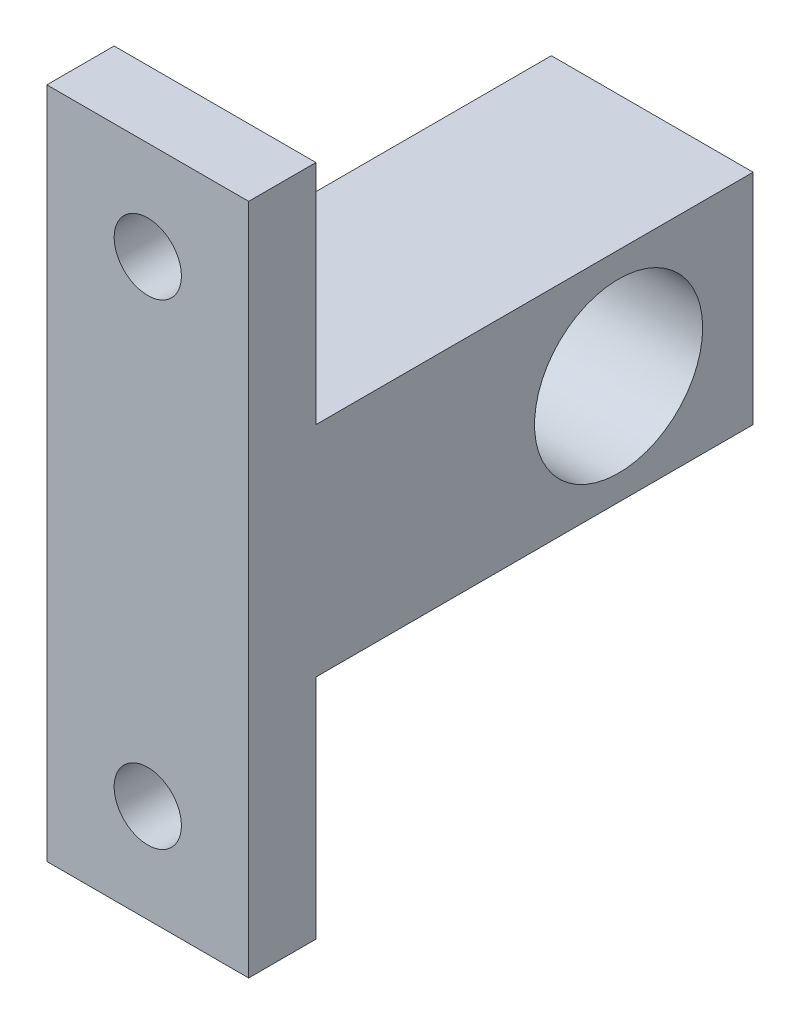
ISO-10303-21;
HEADER;
FILE_DESCRIPTION(('STEP AP214'),'2;1');
FILE_NAME('part.step','',(''),(''),'','','');
FILE_SCHEMA(('AUTOMOTIVE_DESIGN { 1 0 10303 214 1 1 1 1 }'));
ENDSEC;
DATA;
#1=APPLICATION_CONTEXT('core data for automotive mechanical design processes');
#2=APPLICATION_PROTOCOL_DEFINITION('international standard','automotive_design',2000,#1);
#3=PRODUCT_CONTEXT('',#1,'mechanical');
#4=PRODUCT('Part','Part','',(#3));
#5=PRODUCT_RELATED_PRODUCT_CATEGORY('part','',(#4));
#6=PRODUCT_DEFINITION_FORMATION('','',#4);
#7=PRODUCT_DEFINITION_CONTEXT('part definition',#1,'design');
#8=PRODUCT_DEFINITION('design','',#6,#7);
#9=PRODUCT_DEFINITION_SHAPE('','',#8);
#10=(LENGTH_UNIT() NAMED_UNIT(*) SI_UNIT(.MILLI.,.METRE.));
#11=(NAMED_UNIT(*) PLANE_ANGLE_UNIT() SI_UNIT($,.RADIAN.));
#12=(NAMED_UNIT(*) SI_UNIT($,.STERADIAN.) SOLID_ANGLE_UNIT());
#13=UNCERTAINTY_MEASURE_WITH_UNIT(LENGTH_MEASURE(1.E-05),#10,'distance_accuracy_value','');
#14=(GEOMETRIC_REPRESENTATION_CONTEXT(3) GLOBAL_UNCERTAINTY_ASSIGNED_CONTEXT((#13)) GLOBAL_UNIT_ASSIGNED_CONTEXT((#10,
#11,#12)) REPRESENTATION_CONTEXT('',''));
#15=CARTESIAN_POINT('',(0.,0.,0.));
#16=DIRECTION('',(0.,0.,1.));
#17=DIRECTION('',(1.,0.,0.));
#18=AXIS2_PLACEMENT_3D('',#15,#16,#17);
#19=CARTESIAN_POINT('',(6.,0.,0.));
#20=DIRECTION('',(-1.,0.,0.));
#21=DIRECTION('',(0.,0.,1.));
#22=AXIS2_PLACEMENT_3D('',#19,#20,#21);
#23=PLANE('',#22);
#24=DIRECTION('',(0.,0.,1.));
#25=VECTOR('',#24,1.);
#26=CARTESIAN_POINT('',(6.,20.,22.));
#27=LINE('',#26,#25);
#28=CARTESIAN_POINT('',(6.,20.,18.));
#29=VERTEX_POINT('',#28);
#30=CARTESIAN_POINT('',(6.,20.,22.));
#31=VERTEX_POINT('',#30);
#32=EDGE_CURVE('E164',#29,#31,#27,.T.);
#33=ORIENTED_EDGE('',*,*,#32,.T.);
#34=DIRECTION('',(0.,-1.,0.));
#35=VECTOR('',#34,1.);
#36=CARTESIAN_POINT('',(6.,-20.,22.));
#37=LINE('',#36,#35);
#38=CARTESIAN_POINT('',(6.,-20.,22.));
#39=VERTEX_POINT('',#38);
#40=EDGE_CURVE('E100',#31,#39,#37,.T.);
#41=ORIENTED_EDGE('',*,*,#40,.T.);
#42=DIRECTION('',(0.,0.,-1.));
#43=VECTOR('',#42,1.);
#44=CARTESIAN_POINT('',(6.,-20.,22.));
#45=LINE('',#44,#43);
#46=CARTESIAN_POINT('',(6.,-20.,18.));
#47=VERTEX_POINT('',#46);
#48=EDGE_CURVE('E185',#39,#47,#45,.T.);
#49=ORIENTED_EDGE('',*,*,#48,.T.);
#50=DIRECTION('',(0.,1.,0.));
#51=VECTOR('',#50,1.);
#52=CARTESIAN_POINT('',(6.,-20.,18.));
#53=LINE('',#52,#51);
#54=CARTESIAN_POINT('',(6.,-6.5,18.));
#55=VERTEX_POINT('',#54);
#56=EDGE_CURVE('E199',#47,#55,#53,.T.);
#57=ORIENTED_EDGE('',*,*,#56,.T.);
#58=DIRECTION('',(0.,0.,-1.));
#59=VECTOR('',#58,1.);
#60=CARTESIAN_POINT('',(6.,-6.5,18.));
#61=LINE('',#60,#59);
#62=CARTESIAN_POINT('',(6.,-6.5,-8.));
#63=VERTEX_POINT('',#62);
#64=EDGE_CURVE('E119',#55,#63,#61,.T.);
#65=ORIENTED_EDGE('',*,*,#64,.T.);
#66=DIRECTION('',(0.,1.,0.));
#67=VECTOR('',#66,1.);
#68=CARTESIAN_POINT('',(6.,6.5,-8.));
#69=LINE('',#68,#67);
#70=CARTESIAN_POINT('',(6.,6.5,-8.));
#71=VERTEX_POINT('',#70);
#72=EDGE_CURVE('E113',#63,#71,#69,.T.);
#73=ORIENTED_EDGE('',*,*,#72,.T.);
#74=DIRECTION('',(0.,0.,1.));
#75=VECTOR('',#74,1.);
#76=CARTESIAN_POINT('',(6.,6.5,18.));
#77=LINE('',#76,#75);
#78=CARTESIAN_POINT('',(6.,6.5,18.));
#79=VERTEX_POINT('',#78);
#80=EDGE_CURVE('E117',#71,#79,#77,.T.);
#81=ORIENTED_EDGE('',*,*,#80,.T.);
#82=DIRECTION('',(0.,1.,0.));
#83=VECTOR('',#82,1.);
#84=CARTESIAN_POINT('',(6.,20.,18.));
#85=LINE('',#84,#83);
#86=EDGE_CURVE('E57',#79,#29,#85,.T.);
#87=ORIENTED_EDGE('',*,*,#86,.T.);
#88=EDGE_LOOP('',(#33,#41,#49,#57,#65,#73,#81,#87));
#89=FACE_BOUND('',#88,.T.);
#90=CARTESIAN_POINT('',(6.,0.,0.));
#91=DIRECTION('',(1.,0.,0.));
#92=DIRECTION('',(0.,0.,-1.));
#93=AXIS2_PLACEMENT_3D('',#90,#91,#92);
#94=CIRCLE('',#93,5.);
#95=CARTESIAN_POINT('',(6.,0.,-5.));
#96=VERTEX_POINT('',#95);
#97=EDGE_CURVE('E146',#96,#96,#94,.T.);
#98=ORIENTED_EDGE('',*,*,#97,.F.);
#99=EDGE_LOOP('',(#98));
#100=FACE_BOUND('',#99,.T.);
#101=ADVANCED_FACE('F39',(#89,#100),#23,.F.);
#102=CARTESIAN_POINT('',(-6.,0.,0.));
#103=DIRECTION('',(-1.,0.,0.));
#104=DIRECTION('',(0.,0.,1.));
#105=AXIS2_PLACEMENT_3D('',#102,#103,#104);
#106=PLANE('',#105);
#107=DIRECTION('',(0.,0.,1.));
#108=VECTOR('',#107,1.);
#109=CARTESIAN_POINT('',(-6.,20.,22.));
#110=LINE('',#109,#108);
#111=CARTESIAN_POINT('',(-6.,20.,18.));
#112=VERTEX_POINT('',#111);
#113=CARTESIAN_POINT('',(-6.,20.,22.));
#114=VERTEX_POINT('',#113);
#115=EDGE_CURVE('E141',#112,#114,#110,.T.);
#116=ORIENTED_EDGE('',*,*,#115,.F.);
#117=DIRECTION('',(0.,1.,0.));
#118=VECTOR('',#117,1.);
#119=CARTESIAN_POINT('',(-6.,20.,18.));
#120=LINE('',#119,#118);
#121=CARTESIAN_POINT('',(-6.,6.5,18.));
#122=VERTEX_POINT('',#121);
#123=EDGE_CURVE('E92',#122,#112,#120,.T.);
#124=ORIENTED_EDGE('',*,*,#123,.F.);
#125=DIRECTION('',(0.,0.,1.));
#126=VECTOR('',#125,1.);
#127=CARTESIAN_POINT('',(-6.,6.5,18.));
#128=LINE('',#127,#126);
#129=CARTESIAN_POINT('',(-6.,6.5,-8.));
#130=VERTEX_POINT('',#129);
#131=EDGE_CURVE('E86',#130,#122,#128,.T.);
#132=ORIENTED_EDGE('',*,*,#131,.F.);
#133=DIRECTION('',(0.,1.,0.));
#134=VECTOR('',#133,1.);
#135=CARTESIAN_POINT('',(-6.,6.5,-8.));
#136=LINE('',#135,#134);
#137=CARTESIAN_POINT('',(-6.,-6.5,-8.));
#138=VERTEX_POINT('',#137);
#139=EDGE_CURVE('E128',#138,#130,#136,.T.);
#140=ORIENTED_EDGE('',*,*,#139,.F.);
#141=DIRECTION('',(0.,0.,-1.));
#142=VECTOR('',#141,1.);
#143=CARTESIAN_POINT('',(-6.,-6.5,18.));
#144=LINE('',#143,#142);
#145=CARTESIAN_POINT('',(-6.,-6.5,18.));
#146=VERTEX_POINT('',#145);
#147=EDGE_CURVE('E155',#146,#138,#144,.T.);
#148=ORIENTED_EDGE('',*,*,#147,.F.);
#149=DIRECTION('',(0.,1.,0.));
#150=VECTOR('',#149,1.);
#151=CARTESIAN_POINT('',(-6.,-20.,18.));
#152=LINE('',#151,#150);
#153=CARTESIAN_POINT('',(-6.,-20.,18.));
#154=VERTEX_POINT('',#153);
#155=EDGE_CURVE('E152',#154,#146,#152,.T.);
#156=ORIENTED_EDGE('',*,*,#155,.F.);
#157=DIRECTION('',(0.,0.,-1.));
#158=VECTOR('',#157,1.);
#159=CARTESIAN_POINT('',(-6.,-20.,22.));
#160=LINE('',#159,#158);
#161=CARTESIAN_POINT('',(-6.,-20.,22.));
#162=VERTEX_POINT('',#161);
#163=EDGE_CURVE('E149',#162,#154,#160,.T.);
#164=ORIENTED_EDGE('',*,*,#163,.F.);
#165=DIRECTION('',(0.,-1.,0.));
#166=VECTOR('',#165,1.);
#167=CARTESIAN_POINT('',(-6.,-20.,22.));
#168=LINE('',#167,#166);
#169=EDGE_CURVE('E145',#114,#162,#168,.T.);
#170=ORIENTED_EDGE('',*,*,#169,.F.);
#171=EDGE_LOOP('',(#116,#124,#132,#140,#148,#156,#164,#170));
#172=FACE_BOUND('',#171,.T.);
#173=CARTESIAN_POINT('',(-6.,0.,0.));
#174=DIRECTION('',(1.,0.,0.));
#175=DIRECTION('',(0.,0.,-1.));
#176=AXIS2_PLACEMENT_3D('',#173,#174,#175);
#177=CIRCLE('',#176,5.);
#178=CARTESIAN_POINT('',(-6.,0.,-5.));
#179=VERTEX_POINT('',#178);
#180=EDGE_CURVE('E209',#179,#179,#177,.T.);
#181=ORIENTED_EDGE('',*,*,#180,.T.);
#182=EDGE_LOOP('',(#181));
#183=FACE_BOUND('',#182,.T.);
#184=ADVANCED_FACE('F189',(#172,#183),#106,.T.);
#185=CARTESIAN_POINT('',(6.,20.,22.));
#186=DIRECTION('',(0.,-1.,0.));
#187=DIRECTION('',(0.,0.,-1.));
#188=AXIS2_PLACEMENT_3D('',#185,#186,#187);
#189=PLANE('',#188);
#190=ORIENTED_EDGE('',*,*,#115,.T.);
#191=DIRECTION('',(-1.,0.,0.));
#192=VECTOR('',#191,1.);
#193=CARTESIAN_POINT('',(6.,20.,22.));
#194=LINE('',#193,#192);
#195=EDGE_CURVE('E11',#31,#114,#194,.T.);
#196=ORIENTED_EDGE('',*,*,#195,.F.);
#197=ORIENTED_EDGE('',*,*,#32,.F.);
#198=DIRECTION('',(-1.,0.,0.));
#199=VECTOR('',#198,1.);
#200=CARTESIAN_POINT('',(6.,20.,18.));
#201=LINE('',#200,#199);
#202=EDGE_CURVE('E137',#29,#112,#201,.T.);
#203=ORIENTED_EDGE('',*,*,#202,.T.);
#204=EDGE_LOOP('',(#190,#196,#197,#203));
#205=FACE_BOUND('',#204,.T.);
#206=ADVANCED_FACE('F41',(#205),#189,.F.);
#207=CARTESIAN_POINT('',(6.,-20.,22.));
#208=DIRECTION('',(0.,0.,-1.));
#209=DIRECTION('',(-1.,0.,0.));
#210=AXIS2_PLACEMENT_3D('',#207,#208,#209);
#211=PLANE('',#210);
#212=CARTESIAN_POINT('',(0.,14.1497168290535,22.));
#213=DIRECTION('',(0.,0.,-1.));
#214=DIRECTION('',(-1.,0.,0.));
#215=AXIS2_PLACEMENT_3D('',#212,#213,#214);
#216=CIRCLE('',#215,2.);
#217=CARTESIAN_POINT('',(-2.,14.1497168290535,22.));
#218=VERTEX_POINT('',#217);
#219=EDGE_CURVE('E213',#218,#218,#216,.T.);
#220=ORIENTED_EDGE('',*,*,#219,.T.);
#221=EDGE_LOOP('',(#220));
#222=FACE_BOUND('',#221,.T.);
#223=CARTESIAN_POINT('',(0.,-14.1497168290535,22.));
#224=DIRECTION('',(0.,0.,-1.));
#225=DIRECTION('',(1.,0.,0.));
#226=AXIS2_PLACEMENT_3D('',#223,#224,#225);
#227=CIRCLE('',#226,2.);
#228=CARTESIAN_POINT('',(2.,-14.1497168290535,22.));
#229=VERTEX_POINT('',#228);
#230=EDGE_CURVE('E221',#229,#229,#227,.T.);
#231=ORIENTED_EDGE('',*,*,#230,.T.);
#232=EDGE_LOOP('',(#231));
#233=FACE_BOUND('',#232,.T.);
#234=ORIENTED_EDGE('',*,*,#169,.T.);
#235=DIRECTION('',(-1.,0.,0.));
#236=VECTOR('',#235,1.);
#237=CARTESIAN_POINT('',(6.,-20.,22.));
#238=LINE('',#237,#236);
#239=EDGE_CURVE('E49',#39,#162,#238,.T.);
#240=ORIENTED_EDGE('',*,*,#239,.F.);
#241=ORIENTED_EDGE('',*,*,#40,.F.);
#242=ORIENTED_EDGE('',*,*,#195,.T.);
#243=EDGE_LOOP('',(#234,#240,#241,#242));
#244=FACE_BOUND('',#243,.T.);
#245=ADVANCED_FACE('F233',(#222,#233,#244),#211,.F.);
#246=CARTESIAN_POINT('',(6.,-20.,22.));
#247=DIRECTION('',(0.,1.,0.));
#248=DIRECTION('',(0.,0.,1.));
#249=AXIS2_PLACEMENT_3D('',#246,#247,#248);
#250=PLANE('',#249);
#251=ORIENTED_EDGE('',*,*,#163,.T.);
#252=DIRECTION('',(-1.,0.,0.));
#253=VECTOR('',#252,1.);
#254=CARTESIAN_POINT('',(6.,-20.,18.));
#255=LINE('',#254,#253);
#256=EDGE_CURVE('E175',#47,#154,#255,.T.);
#257=ORIENTED_EDGE('',*,*,#256,.F.);
#258=ORIENTED_EDGE('',*,*,#48,.F.);
#259=ORIENTED_EDGE('',*,*,#239,.T.);
#260=EDGE_LOOP('',(#251,#257,#258,#259));
#261=FACE_BOUND('',#260,.T.);
#262=ADVANCED_FACE('F183',(#261),#250,.F.);
#263=CARTESIAN_POINT('',(6.,-20.,18.));
#264=DIRECTION('',(0.,0.,1.));
#265=DIRECTION('',(1.,0.,0.));
#266=AXIS2_PLACEMENT_3D('',#263,#264,#265);
#267=PLANE('',#266);
#268=CARTESIAN_POINT('',(0.,-14.1497168290535,18.));
#269=DIRECTION('',(0.,0.,-1.));
#270=DIRECTION('',(1.,0.,0.));
#271=AXIS2_PLACEMENT_3D('',#268,#269,#270);
#272=CIRCLE('',#271,2.);
#273=CARTESIAN_POINT('',(2.,-14.1497168290535,18.));
#274=VERTEX_POINT('',#273);
#275=EDGE_CURVE('E217',#274,#274,#272,.T.);
#276=ORIENTED_EDGE('',*,*,#275,.F.);
#277=EDGE_LOOP('',(#276));
#278=FACE_BOUND('',#277,.T.);
#279=ORIENTED_EDGE('',*,*,#155,.T.);
#280=DIRECTION('',(-1.,0.,0.));
#281=VECTOR('',#280,1.);
#282=CARTESIAN_POINT('',(6.,-6.5,18.));
#283=LINE('',#282,#281);
#284=EDGE_CURVE('E171',#55,#146,#283,.T.);
#285=ORIENTED_EDGE('',*,*,#284,.F.);
#286=ORIENTED_EDGE('',*,*,#56,.F.);
#287=ORIENTED_EDGE('',*,*,#256,.T.);
#288=EDGE_LOOP('',(#279,#285,#286,#287));
#289=FACE_BOUND('',#288,.T.);
#290=ADVANCED_FACE('F194',(#278,#289),#267,.F.);
#291=CARTESIAN_POINT('',(6.,-6.5,18.));
#292=DIRECTION('',(0.,1.,0.));
#293=DIRECTION('',(0.,0.,1.));
#294=AXIS2_PLACEMENT_3D('',#291,#292,#293);
#295=PLANE('',#294);
#296=ORIENTED_EDGE('',*,*,#147,.T.);
#297=DIRECTION('',(-1.,0.,0.));
#298=VECTOR('',#297,1.);
#299=CARTESIAN_POINT('',(6.,-6.5,-8.));
#300=LINE('',#299,#298);
#301=EDGE_CURVE('E130',#63,#138,#300,.T.);
#302=ORIENTED_EDGE('',*,*,#301,.F.);
#303=ORIENTED_EDGE('',*,*,#64,.F.);
#304=ORIENTED_EDGE('',*,*,#284,.T.);
#305=EDGE_LOOP('',(#296,#302,#303,#304));
#306=FACE_BOUND('',#305,.T.);
#307=ADVANCED_FACE('F197',(#306),#295,.F.);
#308=CARTESIAN_POINT('',(6.,6.5,-8.));
#309=DIRECTION('',(0.,0.,1.));
#310=DIRECTION('',(1.,0.,0.));
#311=AXIS2_PLACEMENT_3D('',#308,#309,#310);
#312=PLANE('',#311);
#313=ORIENTED_EDGE('',*,*,#139,.T.);
#314=DIRECTION('',(-1.,0.,0.));
#315=VECTOR('',#314,1.);
#316=CARTESIAN_POINT('',(6.,6.5,-8.));
#317=LINE('',#316,#315);
#318=EDGE_CURVE('E125',#71,#130,#317,.T.);
#319=ORIENTED_EDGE('',*,*,#318,.F.);
#320=ORIENTED_EDGE('',*,*,#72,.F.);
#321=ORIENTED_EDGE('',*,*,#301,.T.);
#322=EDGE_LOOP('',(#313,#319,#320,#321));
#323=FACE_BOUND('',#322,.T.);
#324=ADVANCED_FACE('F126',(#323),#312,.F.);
#325=CARTESIAN_POINT('',(6.,6.5,18.));
#326=DIRECTION('',(0.,-1.,0.));
#327=DIRECTION('',(0.,0.,-1.));
#328=AXIS2_PLACEMENT_3D('',#325,#326,#327);
#329=PLANE('',#328);
#330=ORIENTED_EDGE('',*,*,#131,.T.);
#331=DIRECTION('',(-1.,0.,0.));
#332=VECTOR('',#331,1.);
#333=CARTESIAN_POINT('',(6.,6.5,18.));
#334=LINE('',#333,#332);
#335=EDGE_CURVE('E131',#79,#122,#334,.T.);
#336=ORIENTED_EDGE('',*,*,#335,.F.);
#337=ORIENTED_EDGE('',*,*,#80,.F.);
#338=ORIENTED_EDGE('',*,*,#318,.T.);
#339=EDGE_LOOP('',(#330,#336,#337,#338));
#340=FACE_BOUND('',#339,.T.);
#341=ADVANCED_FACE('F133',(#340),#329,.F.);
#342=CARTESIAN_POINT('',(6.,20.,18.));
#343=DIRECTION('',(0.,0.,1.));
#344=DIRECTION('',(1.,0.,0.));
#345=AXIS2_PLACEMENT_3D('',#342,#343,#344);
#346=PLANE('',#345);
#347=CARTESIAN_POINT('',(0.,14.1497168290535,18.));
#348=DIRECTION('',(0.,0.,-1.));
#349=DIRECTION('',(-1.,0.,0.));
#350=AXIS2_PLACEMENT_3D('',#347,#348,#349);
#351=CIRCLE('',#350,2.);
#352=CARTESIAN_POINT('',(-2.,14.1497168290535,18.));
#353=VERTEX_POINT('',#352);
#354=EDGE_CURVE('E225',#353,#353,#351,.T.);
#355=ORIENTED_EDGE('',*,*,#354,.F.);
#356=EDGE_LOOP('',(#355));
#357=FACE_BOUND('',#356,.T.);
#358=ORIENTED_EDGE('',*,*,#123,.T.);
#359=ORIENTED_EDGE('',*,*,#202,.F.);
#360=ORIENTED_EDGE('',*,*,#86,.F.);
#361=ORIENTED_EDGE('',*,*,#335,.T.);
#362=EDGE_LOOP('',(#358,#359,#360,#361));
#363=FACE_BOUND('',#362,.T.);
#364=ADVANCED_FACE('F244',(#357,#363),#346,.F.);
#365=CARTESIAN_POINT('',(6.,0.,0.));
#366=DIRECTION('',(-1.,0.,0.));
#367=DIRECTION('',(0.,0.,1.));
#368=AXIS2_PLACEMENT_3D('',#365,#366,#367);
#369=CYLINDRICAL_SURFACE('',#368,5.);
#370=ORIENTED_EDGE('',*,*,#97,.T.);
#371=EDGE_LOOP('',(#370));
#372=FACE_BOUND('',#371,.T.);
#373=ORIENTED_EDGE('',*,*,#180,.F.);
#374=EDGE_LOOP('',(#373));
#375=FACE_BOUND('',#374,.T.);
#376=ADVANCED_FACE('F240',(#372,#375),#369,.F.);
#377=CARTESIAN_POINT('',(0.,14.1497168290535,22.));
#378=DIRECTION('',(0.,0.,-1.));
#379=DIRECTION('',(-1.,0.,0.));
#380=AXIS2_PLACEMENT_3D('',#377,#378,#379);
#381=CYLINDRICAL_SURFACE('',#380,2.);
#382=ORIENTED_EDGE('',*,*,#219,.F.);
#383=EDGE_LOOP('',(#382));
#384=FACE_BOUND('',#383,.T.);
#385=ORIENTED_EDGE('',*,*,#354,.T.);
#386=EDGE_LOOP('',(#385));
#387=FACE_BOUND('',#386,.T.);
#388=ADVANCED_FACE('F236',(#384,#387),#381,.F.);
#389=CARTESIAN_POINT('',(0.,-14.1497168290535,22.));
#390=DIRECTION('',(0.,0.,-1.));
#391=DIRECTION('',(-1.,0.,0.));
#392=AXIS2_PLACEMENT_3D('',#389,#390,#391);
#393=CYLINDRICAL_SURFACE('',#392,2.);
#394=ORIENTED_EDGE('',*,*,#230,.F.);
#395=EDGE_LOOP('',(#394));
#396=FACE_BOUND('',#395,.T.);
#397=ORIENTED_EDGE('',*,*,#275,.T.);
#398=EDGE_LOOP('',(#397));
#399=FACE_BOUND('',#398,.T.);
#400=ADVANCED_FACE('F239',(#396,#399),#393,.F.);
#401=CLOSED_SHELL('',(#101,#184,#206,#245,#262,#290,#307,#324,#341,#364,#376,#388,#400));
#402=MANIFOLD_SOLID_BREP('B2',#401);
#403=ADVANCED_BREP_SHAPE_REPRESENTATION('',(#18,#402),#14);
#404=SHAPE_DEFINITION_REPRESENTATION(#9,#403);
ENDSEC;
END-ISO-10303-21;
